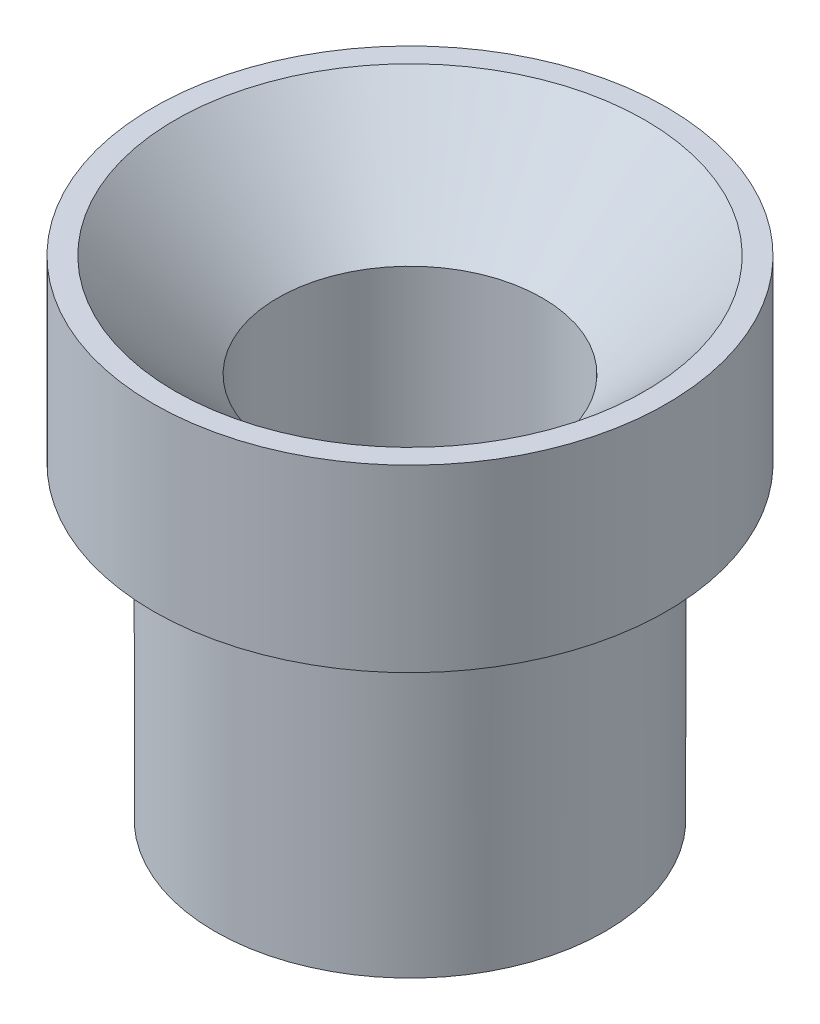
ISO-10303-21;
HEADER;
FILE_DESCRIPTION(('STEP AP214'),'2;1');
FILE_NAME('part.step','',(''),(''),'','','');
FILE_SCHEMA(('AUTOMOTIVE_DESIGN { 1 0 10303 214 1 1 1 1 }'));
ENDSEC;
DATA;
#1=APPLICATION_CONTEXT('core data for automotive mechanical design processes');
#2=APPLICATION_PROTOCOL_DEFINITION('international standard','automotive_design',2000,#1);
#3=PRODUCT_CONTEXT('',#1,'mechanical');
#4=PRODUCT('Part','Part','',(#3));
#5=PRODUCT_RELATED_PRODUCT_CATEGORY('part','',(#4));
#6=PRODUCT_DEFINITION_FORMATION('','',#4);
#7=PRODUCT_DEFINITION_CONTEXT('part definition',#1,'design');
#8=PRODUCT_DEFINITION('design','',#6,#7);
#9=PRODUCT_DEFINITION_SHAPE('','',#8);
#10=(LENGTH_UNIT() NAMED_UNIT(*) SI_UNIT(.MILLI.,.METRE.));
#11=(NAMED_UNIT(*) PLANE_ANGLE_UNIT() SI_UNIT($,.RADIAN.));
#12=(NAMED_UNIT(*) SI_UNIT($,.STERADIAN.) SOLID_ANGLE_UNIT());
#13=UNCERTAINTY_MEASURE_WITH_UNIT(LENGTH_MEASURE(1.E-05),#10,'distance_accuracy_value','');
#14=(GEOMETRIC_REPRESENTATION_CONTEXT(3) GLOBAL_UNCERTAINTY_ASSIGNED_CONTEXT((#13)) GLOBAL_UNIT_ASSIGNED_CONTEXT((#10,
#11,#12)) REPRESENTATION_CONTEXT('',''));
#15=CARTESIAN_POINT('',(0.,0.,0.));
#16=DIRECTION('',(0.,0.,1.));
#17=DIRECTION('',(1.,0.,0.));
#18=AXIS2_PLACEMENT_3D('',#15,#16,#17);
#19=CARTESIAN_POINT('',(0.,0.,0.));
#20=DIRECTION('',(0.,1.,0.));
#21=DIRECTION('',(0.,0.,1.));
#22=AXIS2_PLACEMENT_3D('',#19,#20,#21);
#23=PLANE('',#22);
#24=CARTESIAN_POINT('',(0.,0.,0.));
#25=DIRECTION('',(0.,1.,0.));
#26=DIRECTION('',(0.,0.,1.));
#27=AXIS2_PLACEMENT_3D('',#24,#25,#26);
#28=CIRCLE('',#27,5.);
#29=CARTESIAN_POINT('',(0.,0.,5.));
#30=VERTEX_POINT('',#29);
#31=EDGE_CURVE('E48',#30,#30,#28,.T.);
#32=ORIENTED_EDGE('',*,*,#31,.F.);
#33=EDGE_LOOP('',(#32));
#34=FACE_BOUND('',#33,.T.);
#35=CARTESIAN_POINT('',(0.,0.,0.));
#36=DIRECTION('',(0.,1.,0.));
#37=DIRECTION('',(0.,0.,1.));
#38=AXIS2_PLACEMENT_3D('',#35,#36,#37);
#39=CIRCLE('',#38,3.8);
#40=CARTESIAN_POINT('',(0.,0.,3.8));
#41=VERTEX_POINT('',#40);
#42=EDGE_CURVE('E10',#41,#41,#39,.F.);
#43=ORIENTED_EDGE('',*,*,#42,.F.);
#44=EDGE_LOOP('',(#43));
#45=FACE_BOUND('',#44,.T.);
#46=ADVANCED_FACE('F30',(#34,#45),#23,.F.);
#47=CARTESIAN_POINT('',(0.,3.5,0.));
#48=DIRECTION('',(0.,-1.,0.));
#49=DIRECTION('',(0.,0.,-1.));
#50=AXIS2_PLACEMENT_3D('',#47,#48,#49);
#51=CYLINDRICAL_SURFACE('',#50,5.);
#52=CARTESIAN_POINT('',(0.,3.5,0.));
#53=DIRECTION('',(0.,1.,0.));
#54=DIRECTION('',(0.,0.,1.));
#55=AXIS2_PLACEMENT_3D('',#52,#53,#54);
#56=CIRCLE('',#55,5.);
#57=CARTESIAN_POINT('',(0.,3.5,5.));
#58=VERTEX_POINT('',#57);
#59=EDGE_CURVE('E45',#58,#58,#56,.T.);
#60=ORIENTED_EDGE('',*,*,#59,.F.);
#61=EDGE_LOOP('',(#60));
#62=FACE_BOUND('',#61,.T.);
#63=ORIENTED_EDGE('',*,*,#31,.T.);
#64=EDGE_LOOP('',(#63));
#65=FACE_BOUND('',#64,.T.);
#66=ADVANCED_FACE('F77',(#62,#65),#51,.T.);
#67=CARTESIAN_POINT('',(0.,3.5,0.));
#68=DIRECTION('',(0.,1.,0.));
#69=DIRECTION('',(0.,0.,1.));
#70=AXIS2_PLACEMENT_3D('',#67,#68,#69);
#71=PLANE('',#70);
#72=CARTESIAN_POINT('',(0.,3.5,0.));
#73=DIRECTION('',(0.,1.,0.));
#74=DIRECTION('',(0.,0.,1.));
#75=AXIS2_PLACEMENT_3D('',#72,#73,#74);
#76=CIRCLE('',#75,4.57500000000001);
#77=CARTESIAN_POINT('',(0.,3.5,4.57500000000001));
#78=VERTEX_POINT('',#77);
#79=EDGE_CURVE('E37',#78,#78,#76,.F.);
#80=ORIENTED_EDGE('',*,*,#79,.T.);
#81=EDGE_LOOP('',(#80));
#82=FACE_BOUND('',#81,.T.);
#83=ORIENTED_EDGE('',*,*,#59,.T.);
#84=EDGE_LOOP('',(#83));
#85=FACE_BOUND('',#84,.T.);
#86=ADVANCED_FACE('F83',(#82,#85),#71,.T.);
#87=CARTESIAN_POINT('',(0.,0.,0.));
#88=DIRECTION('',(0.,1.,0.));
#89=DIRECTION('',(0.,0.,1.));
#90=AXIS2_PLACEMENT_3D('',#87,#88,#89);
#91=CYLINDRICAL_SURFACE('',#90,2.575);
#92=CARTESIAN_POINT('',(0.,1.5,0.));
#93=DIRECTION('',(0.,1.,0.));
#94=DIRECTION('',(0.,0.,1.));
#95=AXIS2_PLACEMENT_3D('',#92,#93,#94);
#96=CIRCLE('',#95,2.575);
#97=CARTESIAN_POINT('',(0.,1.5,2.575));
#98=VERTEX_POINT('',#97);
#99=EDGE_CURVE('E41',#98,#98,#96,.T.);
#100=ORIENTED_EDGE('',*,*,#99,.T.);
#101=EDGE_LOOP('',(#100));
#102=FACE_BOUND('',#101,.T.);
#103=CARTESIAN_POINT('',(0.,-6.,0.));
#104=DIRECTION('',(0.,-1.,0.));
#105=DIRECTION('',(0.,0.,-1.));
#106=AXIS2_PLACEMENT_3D('',#103,#104,#105);
#107=CIRCLE('',#106,2.575);
#108=CARTESIAN_POINT('',(0.,-6.,-2.575));
#109=VERTEX_POINT('',#108);
#110=EDGE_CURVE('E56',#109,#109,#107,.T.);
#111=ORIENTED_EDGE('',*,*,#110,.T.);
#112=EDGE_LOOP('',(#111));
#113=FACE_BOUND('',#112,.T.);
#114=ADVANCED_FACE('F60',(#102,#113),#91,.F.);
#115=CARTESIAN_POINT('',(0.,1.5,0.));
#116=DIRECTION('',(0.,1.,0.));
#117=DIRECTION('',(0.,0.,1.));
#118=AXIS2_PLACEMENT_3D('',#115,#116,#117);
#119=CONICAL_SURFACE('',#118,2.575,0.78539816339745);
#120=ORIENTED_EDGE('',*,*,#79,.F.);
#121=EDGE_LOOP('',(#120));
#122=FACE_BOUND('',#121,.T.);
#123=ORIENTED_EDGE('',*,*,#99,.F.);
#124=EDGE_LOOP('',(#123));
#125=FACE_BOUND('',#124,.T.);
#126=ADVANCED_FACE('F32',(#122,#125),#119,.F.);
#127=CARTESIAN_POINT('',(0.,-6.,0.));
#128=DIRECTION('',(0.,1.,0.));
#129=DIRECTION('',(0.,0.,1.));
#130=AXIS2_PLACEMENT_3D('',#127,#128,#129);
#131=CYLINDRICAL_SURFACE('',#130,3.8);
#132=CARTESIAN_POINT('',(0.,-6.,0.));
#133=DIRECTION('',(0.,-1.,0.));
#134=DIRECTION('',(0.,0.,-1.));
#135=AXIS2_PLACEMENT_3D('',#132,#133,#134);
#136=CIRCLE('',#135,3.8);
#137=CARTESIAN_POINT('',(0.,-6.,-3.8));
#138=VERTEX_POINT('',#137);
#139=EDGE_CURVE('E51',#138,#138,#136,.T.);
#140=ORIENTED_EDGE('',*,*,#139,.F.);
#141=EDGE_LOOP('',(#140));
#142=FACE_BOUND('',#141,.T.);
#143=ORIENTED_EDGE('',*,*,#42,.T.);
#144=EDGE_LOOP('',(#143));
#145=FACE_BOUND('',#144,.T.);
#146=ADVANCED_FACE('F65',(#142,#145),#131,.T.);
#147=CARTESIAN_POINT('',(0.,-6.,0.));
#148=DIRECTION('',(0.,-1.,0.));
#149=DIRECTION('',(0.,0.,-1.));
#150=AXIS2_PLACEMENT_3D('',#147,#148,#149);
#151=PLANE('',#150);
#152=ORIENTED_EDGE('',*,*,#110,.F.);
#153=EDGE_LOOP('',(#152));
#154=FACE_BOUND('',#153,.T.);
#155=ORIENTED_EDGE('',*,*,#139,.T.);
#156=EDGE_LOOP('',(#155));
#157=FACE_BOUND('',#156,.T.);
#158=ADVANCED_FACE('F62',(#154,#157),#151,.T.);
#159=CLOSED_SHELL('',(#46,#66,#86,#114,#126,#146,#158));
#160=MANIFOLD_SOLID_BREP('B2',#159);
#161=ADVANCED_BREP_SHAPE_REPRESENTATION('',(#18,#160),#14);
#162=SHAPE_DEFINITION_REPRESENTATION(#9,#161);
ENDSEC;
END-ISO-10303-21;
